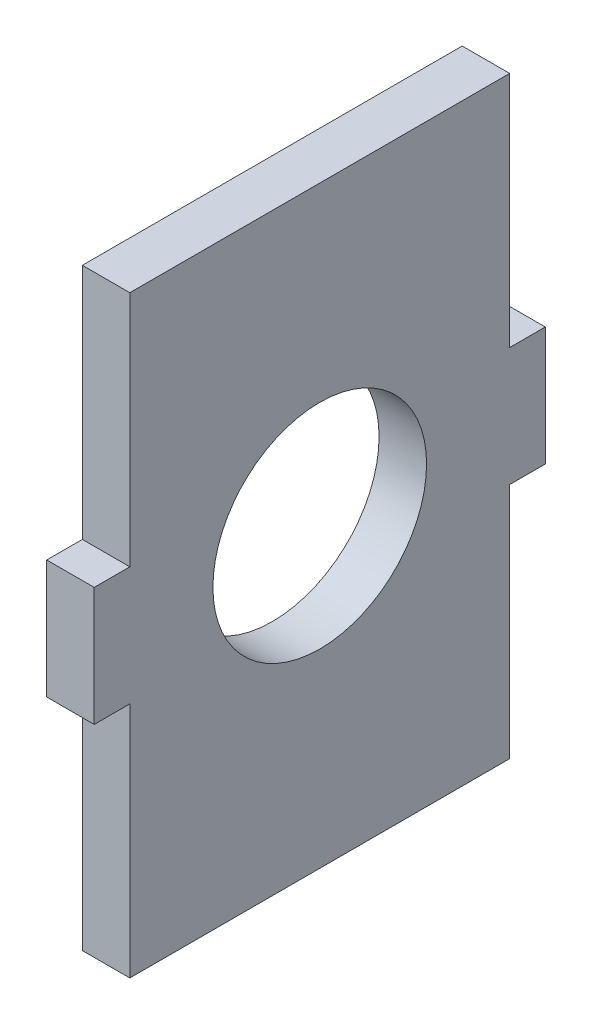
ISO-10303-21;
HEADER;
FILE_DESCRIPTION(('STEP AP214'),'2;1');
FILE_NAME('part.step','',(''),(''),'','','');
FILE_SCHEMA(('AUTOMOTIVE_DESIGN { 1 0 10303 214 1 1 1 1 }'));
ENDSEC;
DATA;
#1=APPLICATION_CONTEXT('core data for automotive mechanical design processes');
#2=APPLICATION_PROTOCOL_DEFINITION('international standard','automotive_design',2000,#1);
#3=PRODUCT_CONTEXT('',#1,'mechanical');
#4=PRODUCT('Part','Part','',(#3));
#5=PRODUCT_RELATED_PRODUCT_CATEGORY('part','',(#4));
#6=PRODUCT_DEFINITION_FORMATION('','',#4);
#7=PRODUCT_DEFINITION_CONTEXT('part definition',#1,'design');
#8=PRODUCT_DEFINITION('design','',#6,#7);
#9=PRODUCT_DEFINITION_SHAPE('','',#8);
#10=(LENGTH_UNIT() NAMED_UNIT(*) SI_UNIT(.MILLI.,.METRE.));
#11=(NAMED_UNIT(*) PLANE_ANGLE_UNIT() SI_UNIT($,.RADIAN.));
#12=(NAMED_UNIT(*) SI_UNIT($,.STERADIAN.) SOLID_ANGLE_UNIT());
#13=UNCERTAINTY_MEASURE_WITH_UNIT(LENGTH_MEASURE(1.E-05),#10,'distance_accuracy_value','');
#14=(GEOMETRIC_REPRESENTATION_CONTEXT(3) GLOBAL_UNCERTAINTY_ASSIGNED_CONTEXT((#13)) GLOBAL_UNIT_ASSIGNED_CONTEXT((#10,
#11,#12)) REPRESENTATION_CONTEXT('',''));
#15=CARTESIAN_POINT('',(0.,0.,0.));
#16=DIRECTION('',(0.,0.,1.));
#17=DIRECTION('',(1.,0.,0.));
#18=AXIS2_PLACEMENT_3D('',#15,#16,#17);
#19=CARTESIAN_POINT('',(70.,4.5,36.));
#20=DIRECTION('',(0.,1.,0.));
#21=DIRECTION('',(0.,0.,1.));
#22=AXIS2_PLACEMENT_3D('',#19,#20,#21);
#23=PLANE('',#22);
#24=DIRECTION('',(0.,0.,1.));
#25=VECTOR('',#24,1.);
#26=CARTESIAN_POINT('',(74.,4.5,36.));
#27=LINE('',#26,#25);
#28=CARTESIAN_POINT('',(74.,4.49999999999999,4.));
#29=VERTEX_POINT('',#28);
#30=CARTESIAN_POINT('',(74.,4.5,36.));
#31=VERTEX_POINT('',#30);
#32=EDGE_CURVE('E170',#29,#31,#27,.T.);
#33=ORIENTED_EDGE('',*,*,#32,.F.);
#34=DIRECTION('',(1.,0.,0.));
#35=VECTOR('',#34,1.);
#36=CARTESIAN_POINT('',(70.,4.49999999999999,4.));
#37=LINE('',#36,#35);
#38=CARTESIAN_POINT('',(70.,4.49999999999999,4.));
#39=VERTEX_POINT('',#38);
#40=EDGE_CURVE('E11',#39,#29,#37,.T.);
#41=ORIENTED_EDGE('',*,*,#40,.F.);
#42=DIRECTION('',(0.,0.,1.));
#43=VECTOR('',#42,1.);
#44=CARTESIAN_POINT('',(70.,4.5,36.));
#45=LINE('',#44,#43);
#46=CARTESIAN_POINT('',(70.,4.5,36.));
#47=VERTEX_POINT('',#46);
#48=EDGE_CURVE('E215',#39,#47,#45,.T.);
#49=ORIENTED_EDGE('',*,*,#48,.T.);
#50=DIRECTION('',(1.,0.,0.));
#51=VECTOR('',#50,1.);
#52=CARTESIAN_POINT('',(70.,4.5,36.));
#53=LINE('',#52,#51);
#54=EDGE_CURVE('E45',#47,#31,#53,.T.);
#55=ORIENTED_EDGE('',*,*,#54,.T.);
#56=EDGE_LOOP('',(#33,#41,#49,#55));
#57=FACE_BOUND('',#56,.T.);
#58=ADVANCED_FACE('F42',(#57),#23,.T.);
#59=CARTESIAN_POINT('',(70.,4.49999999999999,4.));
#60=DIRECTION('',(0.,0.,-1.));
#61=DIRECTION('',(0.,1.,0.));
#62=AXIS2_PLACEMENT_3D('',#59,#60,#61);
#63=PLANE('',#62);
#64=DIRECTION('',(0.,1.,0.));
#65=VECTOR('',#64,1.);
#66=CARTESIAN_POINT('',(74.,4.49999999999999,4.));
#67=LINE('',#66,#65);
#68=CARTESIAN_POINT('',(74.,-15.5,3.99999999999998));
#69=VERTEX_POINT('',#68);
#70=EDGE_CURVE('E212',#69,#29,#67,.T.);
#71=ORIENTED_EDGE('',*,*,#70,.F.);
#72=DIRECTION('',(1.,0.,0.));
#73=VECTOR('',#72,1.);
#74=CARTESIAN_POINT('',(70.,-15.5,3.99999999999998));
#75=LINE('',#74,#73);
#76=CARTESIAN_POINT('',(70.,-15.5,3.99999999999998));
#77=VERTEX_POINT('',#76);
#78=EDGE_CURVE('E52',#77,#69,#75,.T.);
#79=ORIENTED_EDGE('',*,*,#78,.F.);
#80=DIRECTION('',(0.,1.,0.));
#81=VECTOR('',#80,1.);
#82=CARTESIAN_POINT('',(70.,4.49999999999999,4.));
#83=LINE('',#82,#81);
#84=EDGE_CURVE('E155',#77,#39,#83,.T.);
#85=ORIENTED_EDGE('',*,*,#84,.T.);
#86=ORIENTED_EDGE('',*,*,#40,.T.);
#87=EDGE_LOOP('',(#71,#79,#85,#86));
#88=FACE_BOUND('',#87,.T.);
#89=ADVANCED_FACE('F248',(#88),#63,.T.);
#90=CARTESIAN_POINT('',(70.,-15.5,3.99999999999998));
#91=DIRECTION('',(0.,1.,0.));
#92=DIRECTION('',(0.,0.,1.));
#93=AXIS2_PLACEMENT_3D('',#90,#91,#92);
#94=PLANE('',#93);
#95=DIRECTION('',(0.,0.,1.));
#96=VECTOR('',#95,1.);
#97=CARTESIAN_POINT('',(74.,-15.5,3.99999999999998));
#98=LINE('',#97,#96);
#99=CARTESIAN_POINT('',(74.,-15.5,1.00000000000001));
#100=VERTEX_POINT('',#99);
#101=EDGE_CURVE('E141',#100,#69,#98,.T.);
#102=ORIENTED_EDGE('',*,*,#101,.F.);
#103=DIRECTION('',(1.,0.,0.));
#104=VECTOR('',#103,1.);
#105=CARTESIAN_POINT('',(70.,-15.5,1.00000000000001));
#106=LINE('',#105,#104);
#107=CARTESIAN_POINT('',(70.,-15.5,1.00000000000001));
#108=VERTEX_POINT('',#107);
#109=EDGE_CURVE('E136',#108,#100,#106,.T.);
#110=ORIENTED_EDGE('',*,*,#109,.F.);
#111=DIRECTION('',(0.,0.,1.));
#112=VECTOR('',#111,1.);
#113=CARTESIAN_POINT('',(70.,-15.5,3.99999999999998));
#114=LINE('',#113,#112);
#115=EDGE_CURVE('E139',#108,#77,#114,.T.);
#116=ORIENTED_EDGE('',*,*,#115,.T.);
#117=ORIENTED_EDGE('',*,*,#78,.T.);
#118=EDGE_LOOP('',(#102,#110,#116,#117));
#119=FACE_BOUND('',#118,.T.);
#120=ADVANCED_FACE('F138',(#119),#94,.T.);
#121=CARTESIAN_POINT('',(70.,-15.5,1.00000000000001));
#122=DIRECTION('',(0.,0.,-1.));
#123=DIRECTION('',(0.,1.,0.));
#124=AXIS2_PLACEMENT_3D('',#121,#122,#123);
#125=PLANE('',#124);
#126=DIRECTION('',(0.,1.,0.));
#127=VECTOR('',#126,1.);
#128=CARTESIAN_POINT('',(74.,-15.5,1.00000000000001));
#129=LINE('',#128,#127);
#130=CARTESIAN_POINT('',(74.,-25.5,1.00000000000001));
#131=VERTEX_POINT('',#130);
#132=EDGE_CURVE('E207',#131,#100,#129,.T.);
#133=ORIENTED_EDGE('',*,*,#132,.F.);
#134=DIRECTION('',(1.,0.,0.));
#135=VECTOR('',#134,1.);
#136=CARTESIAN_POINT('',(70.,-25.5,1.00000000000001));
#137=LINE('',#136,#135);
#138=CARTESIAN_POINT('',(70.,-25.5,1.00000000000001));
#139=VERTEX_POINT('',#138);
#140=EDGE_CURVE('E147',#139,#131,#137,.T.);
#141=ORIENTED_EDGE('',*,*,#140,.F.);
#142=DIRECTION('',(0.,1.,0.));
#143=VECTOR('',#142,1.);
#144=CARTESIAN_POINT('',(70.,-15.5,1.00000000000001));
#145=LINE('',#144,#143);
#146=EDGE_CURVE('E153',#139,#108,#145,.T.);
#147=ORIENTED_EDGE('',*,*,#146,.T.);
#148=ORIENTED_EDGE('',*,*,#109,.T.);
#149=EDGE_LOOP('',(#133,#141,#147,#148));
#150=FACE_BOUND('',#149,.T.);
#151=ADVANCED_FACE('F158',(#150),#125,.T.);
#152=CARTESIAN_POINT('',(70.,-25.5,1.00000000000001));
#153=DIRECTION('',(0.,-1.,0.));
#154=DIRECTION('',(0.,0.,-1.));
#155=AXIS2_PLACEMENT_3D('',#152,#153,#154);
#156=PLANE('',#155);
#157=DIRECTION('',(0.,0.,-1.));
#158=VECTOR('',#157,1.);
#159=CARTESIAN_POINT('',(74.,-25.5,1.00000000000001));
#160=LINE('',#159,#158);
#161=CARTESIAN_POINT('',(74.,-25.5,3.99999999999999));
#162=VERTEX_POINT('',#161);
#163=EDGE_CURVE('E203',#162,#131,#160,.T.);
#164=ORIENTED_EDGE('',*,*,#163,.F.);
#165=DIRECTION('',(1.,0.,0.));
#166=VECTOR('',#165,1.);
#167=CARTESIAN_POINT('',(70.,-25.5,3.99999999999999));
#168=LINE('',#167,#166);
#169=CARTESIAN_POINT('',(70.,-25.5,3.99999999999999));
#170=VERTEX_POINT('',#169);
#171=EDGE_CURVE('E221',#170,#162,#168,.T.);
#172=ORIENTED_EDGE('',*,*,#171,.F.);
#173=DIRECTION('',(0.,0.,-1.));
#174=VECTOR('',#173,1.);
#175=CARTESIAN_POINT('',(70.,-25.5,1.00000000000001));
#176=LINE('',#175,#174);
#177=EDGE_CURVE('E160',#170,#139,#176,.T.);
#178=ORIENTED_EDGE('',*,*,#177,.T.);
#179=ORIENTED_EDGE('',*,*,#140,.T.);
#180=EDGE_LOOP('',(#164,#172,#178,#179));
#181=FACE_BOUND('',#180,.T.);
#182=ADVANCED_FACE('F261',(#181),#156,.T.);
#183=CARTESIAN_POINT('',(70.,-25.5,3.99999999999999));
#184=DIRECTION('',(0.,0.,-1.));
#185=DIRECTION('',(0.,1.,0.));
#186=AXIS2_PLACEMENT_3D('',#183,#184,#185);
#187=PLANE('',#186);
#188=DIRECTION('',(0.,1.,0.));
#189=VECTOR('',#188,1.);
#190=CARTESIAN_POINT('',(74.,-25.5,3.99999999999999));
#191=LINE('',#190,#189);
#192=CARTESIAN_POINT('',(74.,-45.5,4.00000000000001));
#193=VERTEX_POINT('',#192);
#194=EDGE_CURVE('E199',#193,#162,#191,.T.);
#195=ORIENTED_EDGE('',*,*,#194,.F.);
#196=DIRECTION('',(1.,0.,0.));
#197=VECTOR('',#196,1.);
#198=CARTESIAN_POINT('',(70.,-45.5,4.00000000000001));
#199=LINE('',#198,#197);
#200=CARTESIAN_POINT('',(70.,-45.5,4.00000000000001));
#201=VERTEX_POINT('',#200);
#202=EDGE_CURVE('E224',#201,#193,#199,.T.);
#203=ORIENTED_EDGE('',*,*,#202,.F.);
#204=DIRECTION('',(0.,1.,0.));
#205=VECTOR('',#204,1.);
#206=CARTESIAN_POINT('',(70.,-25.5,3.99999999999999));
#207=LINE('',#206,#205);
#208=EDGE_CURVE('E164',#201,#170,#207,.T.);
#209=ORIENTED_EDGE('',*,*,#208,.T.);
#210=ORIENTED_EDGE('',*,*,#171,.T.);
#211=EDGE_LOOP('',(#195,#203,#209,#210));
#212=FACE_BOUND('',#211,.T.);
#213=ADVANCED_FACE('F264',(#212),#187,.T.);
#214=CARTESIAN_POINT('',(70.,-45.5,36.));
#215=DIRECTION('',(0.,-1.,0.));
#216=DIRECTION('',(0.,0.,-1.));
#217=AXIS2_PLACEMENT_3D('',#214,#215,#216);
#218=PLANE('',#217);
#219=DIRECTION('',(0.,0.,-1.));
#220=VECTOR('',#219,1.);
#221=CARTESIAN_POINT('',(74.,-45.5,36.));
#222=LINE('',#221,#220);
#223=CARTESIAN_POINT('',(74.,-45.5,36.));
#224=VERTEX_POINT('',#223);
#225=EDGE_CURVE('E195',#224,#193,#222,.T.);
#226=ORIENTED_EDGE('',*,*,#225,.F.);
#227=DIRECTION('',(1.,0.,0.));
#228=VECTOR('',#227,1.);
#229=CARTESIAN_POINT('',(70.,-45.5,36.));
#230=LINE('',#229,#228);
#231=CARTESIAN_POINT('',(70.,-45.5,36.));
#232=VERTEX_POINT('',#231);
#233=EDGE_CURVE('E227',#232,#224,#230,.T.);
#234=ORIENTED_EDGE('',*,*,#233,.F.);
#235=DIRECTION('',(0.,0.,-1.));
#236=VECTOR('',#235,1.);
#237=CARTESIAN_POINT('',(70.,-45.5,36.));
#238=LINE('',#237,#236);
#239=EDGE_CURVE('E335',#232,#201,#238,.T.);
#240=ORIENTED_EDGE('',*,*,#239,.T.);
#241=ORIENTED_EDGE('',*,*,#202,.T.);
#242=EDGE_LOOP('',(#226,#234,#240,#241));
#243=FACE_BOUND('',#242,.T.);
#244=ADVANCED_FACE('F268',(#243),#218,.T.);
#245=CARTESIAN_POINT('',(70.,-25.5,36.));
#246=DIRECTION('',(0.,0.,1.));
#247=DIRECTION('',(0.,-1.,0.));
#248=AXIS2_PLACEMENT_3D('',#245,#246,#247);
#249=PLANE('',#248);
#250=DIRECTION('',(0.,-1.,0.));
#251=VECTOR('',#250,1.);
#252=CARTESIAN_POINT('',(74.,-25.5,36.));
#253=LINE('',#252,#251);
#254=CARTESIAN_POINT('',(74.,-25.5,36.));
#255=VERTEX_POINT('',#254);
#256=EDGE_CURVE('E191',#255,#224,#253,.T.);
#257=ORIENTED_EDGE('',*,*,#256,.F.);
#258=DIRECTION('',(1.,0.,0.));
#259=VECTOR('',#258,1.);
#260=CARTESIAN_POINT('',(70.,-25.5,36.));
#261=LINE('',#260,#259);
#262=CARTESIAN_POINT('',(70.,-25.5,36.));
#263=VERTEX_POINT('',#262);
#264=EDGE_CURVE('E230',#263,#255,#261,.T.);
#265=ORIENTED_EDGE('',*,*,#264,.F.);
#266=DIRECTION('',(0.,-1.,0.));
#267=VECTOR('',#266,1.);
#268=CARTESIAN_POINT('',(70.,-25.5,36.));
#269=LINE('',#268,#267);
#270=EDGE_CURVE('E331',#263,#232,#269,.T.);
#271=ORIENTED_EDGE('',*,*,#270,.T.);
#272=ORIENTED_EDGE('',*,*,#233,.T.);
#273=EDGE_LOOP('',(#257,#265,#271,#272));
#274=FACE_BOUND('',#273,.T.);
#275=ADVANCED_FACE('F272',(#274),#249,.T.);
#276=CARTESIAN_POINT('',(70.,-25.5,39.));
#277=DIRECTION('',(0.,-1.,0.));
#278=DIRECTION('',(0.,0.,-1.));
#279=AXIS2_PLACEMENT_3D('',#276,#277,#278);
#280=PLANE('',#279);
#281=DIRECTION('',(0.,0.,-1.));
#282=VECTOR('',#281,1.);
#283=CARTESIAN_POINT('',(74.,-25.5,39.));
#284=LINE('',#283,#282);
#285=CARTESIAN_POINT('',(74.,-25.5,39.));
#286=VERTEX_POINT('',#285);
#287=EDGE_CURVE('E187',#286,#255,#284,.T.);
#288=ORIENTED_EDGE('',*,*,#287,.F.);
#289=DIRECTION('',(1.,0.,0.));
#290=VECTOR('',#289,1.);
#291=CARTESIAN_POINT('',(70.,-25.5,39.));
#292=LINE('',#291,#290);
#293=CARTESIAN_POINT('',(70.,-25.5,39.));
#294=VERTEX_POINT('',#293);
#295=EDGE_CURVE('E233',#294,#286,#292,.T.);
#296=ORIENTED_EDGE('',*,*,#295,.F.);
#297=DIRECTION('',(0.,0.,-1.));
#298=VECTOR('',#297,1.);
#299=CARTESIAN_POINT('',(70.,-25.5,39.));
#300=LINE('',#299,#298);
#301=EDGE_CURVE('E327',#294,#263,#300,.T.);
#302=ORIENTED_EDGE('',*,*,#301,.T.);
#303=ORIENTED_EDGE('',*,*,#264,.T.);
#304=EDGE_LOOP('',(#288,#296,#302,#303));
#305=FACE_BOUND('',#304,.T.);
#306=ADVANCED_FACE('F276',(#305),#280,.T.);
#307=CARTESIAN_POINT('',(70.,-15.5,39.));
#308=DIRECTION('',(0.,0.,1.));
#309=DIRECTION('',(1.,0.,0.));
#310=AXIS2_PLACEMENT_3D('',#307,#308,#309);
#311=PLANE('',#310);
#312=DIRECTION('',(0.,-1.,0.));
#313=VECTOR('',#312,1.);
#314=CARTESIAN_POINT('',(74.,-15.5,39.));
#315=LINE('',#314,#313);
#316=CARTESIAN_POINT('',(74.,-15.5,39.));
#317=VERTEX_POINT('',#316);
#318=EDGE_CURVE('E183',#317,#286,#315,.T.);
#319=ORIENTED_EDGE('',*,*,#318,.F.);
#320=DIRECTION('',(1.,0.,0.));
#321=VECTOR('',#320,1.);
#322=CARTESIAN_POINT('',(70.,-15.5,39.));
#323=LINE('',#322,#321);
#324=CARTESIAN_POINT('',(70.,-15.5,39.));
#325=VERTEX_POINT('',#324);
#326=EDGE_CURVE('E236',#325,#317,#323,.T.);
#327=ORIENTED_EDGE('',*,*,#326,.F.);
#328=DIRECTION('',(0.,-1.,0.));
#329=VECTOR('',#328,1.);
#330=CARTESIAN_POINT('',(70.,-15.5,39.));
#331=LINE('',#330,#329);
#332=EDGE_CURVE('E323',#325,#294,#331,.T.);
#333=ORIENTED_EDGE('',*,*,#332,.T.);
#334=ORIENTED_EDGE('',*,*,#295,.T.);
#335=EDGE_LOOP('',(#319,#327,#333,#334));
#336=FACE_BOUND('',#335,.T.);
#337=ADVANCED_FACE('F280',(#336),#311,.T.);
#338=CARTESIAN_POINT('',(70.,-15.5,36.));
#339=DIRECTION('',(0.,1.,0.));
#340=DIRECTION('',(0.,0.,1.));
#341=AXIS2_PLACEMENT_3D('',#338,#339,#340);
#342=PLANE('',#341);
#343=DIRECTION('',(0.,0.,1.));
#344=VECTOR('',#343,1.);
#345=CARTESIAN_POINT('',(74.,-15.5,36.));
#346=LINE('',#345,#344);
#347=CARTESIAN_POINT('',(74.,-15.5,36.));
#348=VERTEX_POINT('',#347);
#349=EDGE_CURVE('E179',#348,#317,#346,.T.);
#350=ORIENTED_EDGE('',*,*,#349,.F.);
#351=DIRECTION('',(1.,0.,0.));
#352=VECTOR('',#351,1.);
#353=CARTESIAN_POINT('',(70.,-15.5,36.));
#354=LINE('',#353,#352);
#355=CARTESIAN_POINT('',(70.,-15.5,36.));
#356=VERTEX_POINT('',#355);
#357=EDGE_CURVE('E238',#356,#348,#354,.T.);
#358=ORIENTED_EDGE('',*,*,#357,.F.);
#359=DIRECTION('',(0.,0.,1.));
#360=VECTOR('',#359,1.);
#361=CARTESIAN_POINT('',(70.,-15.5,36.));
#362=LINE('',#361,#360);
#363=EDGE_CURVE('E319',#356,#325,#362,.T.);
#364=ORIENTED_EDGE('',*,*,#363,.T.);
#365=ORIENTED_EDGE('',*,*,#326,.T.);
#366=EDGE_LOOP('',(#350,#358,#364,#365));
#367=FACE_BOUND('',#366,.T.);
#368=ADVANCED_FACE('F284',(#367),#342,.T.);
#369=CARTESIAN_POINT('',(70.,4.5,36.));
#370=DIRECTION('',(0.,0.,1.));
#371=DIRECTION('',(0.,-1.,0.));
#372=AXIS2_PLACEMENT_3D('',#369,#370,#371);
#373=PLANE('',#372);
#374=DIRECTION('',(0.,-1.,0.));
#375=VECTOR('',#374,1.);
#376=CARTESIAN_POINT('',(74.,4.5,36.));
#377=LINE('',#376,#375);
#378=EDGE_CURVE('E174',#31,#348,#377,.T.);
#379=ORIENTED_EDGE('',*,*,#378,.F.);
#380=ORIENTED_EDGE('',*,*,#54,.F.);
#381=DIRECTION('',(0.,-1.,0.));
#382=VECTOR('',#381,1.);
#383=CARTESIAN_POINT('',(70.,4.5,36.));
#384=LINE('',#383,#382);
#385=EDGE_CURVE('E316',#47,#356,#384,.T.);
#386=ORIENTED_EDGE('',*,*,#385,.T.);
#387=ORIENTED_EDGE('',*,*,#357,.T.);
#388=EDGE_LOOP('',(#379,#380,#386,#387));
#389=FACE_BOUND('',#388,.T.);
#390=ADVANCED_FACE('F245',(#389),#373,.T.);
#391=CARTESIAN_POINT('',(70.,0.,0.));
#392=DIRECTION('',(-1.,0.,0.));
#393=DIRECTION('',(0.,0.,1.));
#394=AXIS2_PLACEMENT_3D('',#391,#392,#393);
#395=PLANE('',#394);
#396=CARTESIAN_POINT('',(70.,-20.5,20.));
#397=DIRECTION('',(-1.,0.,0.));
#398=DIRECTION('',(0.,0.,1.));
#399=AXIS2_PLACEMENT_3D('',#396,#397,#398);
#400=CIRCLE('',#399,9.);
#401=CARTESIAN_POINT('',(70.,-20.5,29.));
#402=VERTEX_POINT('',#401);
#403=EDGE_CURVE('E306',#402,#402,#400,.F.);
#404=ORIENTED_EDGE('',*,*,#403,.T.);
#405=EDGE_LOOP('',(#404));
#406=FACE_BOUND('',#405,.T.);
#407=ORIENTED_EDGE('',*,*,#48,.F.);
#408=ORIENTED_EDGE('',*,*,#84,.F.);
#409=ORIENTED_EDGE('',*,*,#115,.F.);
#410=ORIENTED_EDGE('',*,*,#146,.F.);
#411=ORIENTED_EDGE('',*,*,#177,.F.);
#412=ORIENTED_EDGE('',*,*,#208,.F.);
#413=ORIENTED_EDGE('',*,*,#239,.F.);
#414=ORIENTED_EDGE('',*,*,#270,.F.);
#415=ORIENTED_EDGE('',*,*,#301,.F.);
#416=ORIENTED_EDGE('',*,*,#332,.F.);
#417=ORIENTED_EDGE('',*,*,#363,.F.);
#418=ORIENTED_EDGE('',*,*,#385,.F.);
#419=EDGE_LOOP('',(#407,#408,#409,#410,#411,#412,#413,#414,#415,#416,#417,#418));
#420=FACE_BOUND('',#419,.T.);
#421=ADVANCED_FACE('F151',(#406,#420),#395,.T.);
#422=CARTESIAN_POINT('',(74.,0.,0.));
#423=DIRECTION('',(-1.,0.,0.));
#424=DIRECTION('',(0.,0.,1.));
#425=AXIS2_PLACEMENT_3D('',#422,#423,#424);
#426=PLANE('',#425);
#427=CARTESIAN_POINT('',(74.,-20.5,20.));
#428=DIRECTION('',(1.,0.,0.));
#429=DIRECTION('',(0.,0.,-1.));
#430=AXIS2_PLACEMENT_3D('',#427,#428,#429);
#431=CIRCLE('',#430,9.);
#432=CARTESIAN_POINT('',(74.,-20.5,11.));
#433=VERTEX_POINT('',#432);
#434=EDGE_CURVE('E175',#433,#433,#431,.T.);
#435=ORIENTED_EDGE('',*,*,#434,.F.);
#436=EDGE_LOOP('',(#435));
#437=FACE_BOUND('',#436,.T.);
#438=ORIENTED_EDGE('',*,*,#32,.T.);
#439=ORIENTED_EDGE('',*,*,#378,.T.);
#440=ORIENTED_EDGE('',*,*,#349,.T.);
#441=ORIENTED_EDGE('',*,*,#318,.T.);
#442=ORIENTED_EDGE('',*,*,#287,.T.);
#443=ORIENTED_EDGE('',*,*,#256,.T.);
#444=ORIENTED_EDGE('',*,*,#225,.T.);
#445=ORIENTED_EDGE('',*,*,#194,.T.);
#446=ORIENTED_EDGE('',*,*,#163,.T.);
#447=ORIENTED_EDGE('',*,*,#132,.T.);
#448=ORIENTED_EDGE('',*,*,#101,.T.);
#449=ORIENTED_EDGE('',*,*,#70,.T.);
#450=EDGE_LOOP('',(#438,#439,#440,#441,#442,#443,#444,#445,#446,#447,#448,#449));
#451=FACE_BOUND('',#450,.T.);
#452=ADVANCED_FACE('F247',(#437,#451),#426,.F.);
#453=CARTESIAN_POINT('',(-38.001,-20.5,20.));
#454=DIRECTION('',(1.,0.,0.));
#455=DIRECTION('',(0.,0.,-1.));
#456=AXIS2_PLACEMENT_3D('',#453,#454,#455);
#457=CYLINDRICAL_SURFACE('',#456,9.);
#458=ORIENTED_EDGE('',*,*,#403,.F.);
#459=EDGE_LOOP('',(#458));
#460=FACE_BOUND('',#459,.T.);
#461=ORIENTED_EDGE('',*,*,#434,.T.);
#462=EDGE_LOOP('',(#461));
#463=FACE_BOUND('',#462,.T.);
#464=ADVANCED_FACE('F296',(#460,#463),#457,.F.);
#465=CLOSED_SHELL('',(#58,#89,#120,#151,#182,#213,#244,#275,#306,#337,#368,#390,#421,#452,#464));
#466=MANIFOLD_SOLID_BREP('B2',#465);
#467=ADVANCED_BREP_SHAPE_REPRESENTATION('',(#18,#466),#14);
#468=SHAPE_DEFINITION_REPRESENTATION(#9,#467);
ENDSEC;
END-ISO-10303-21;
